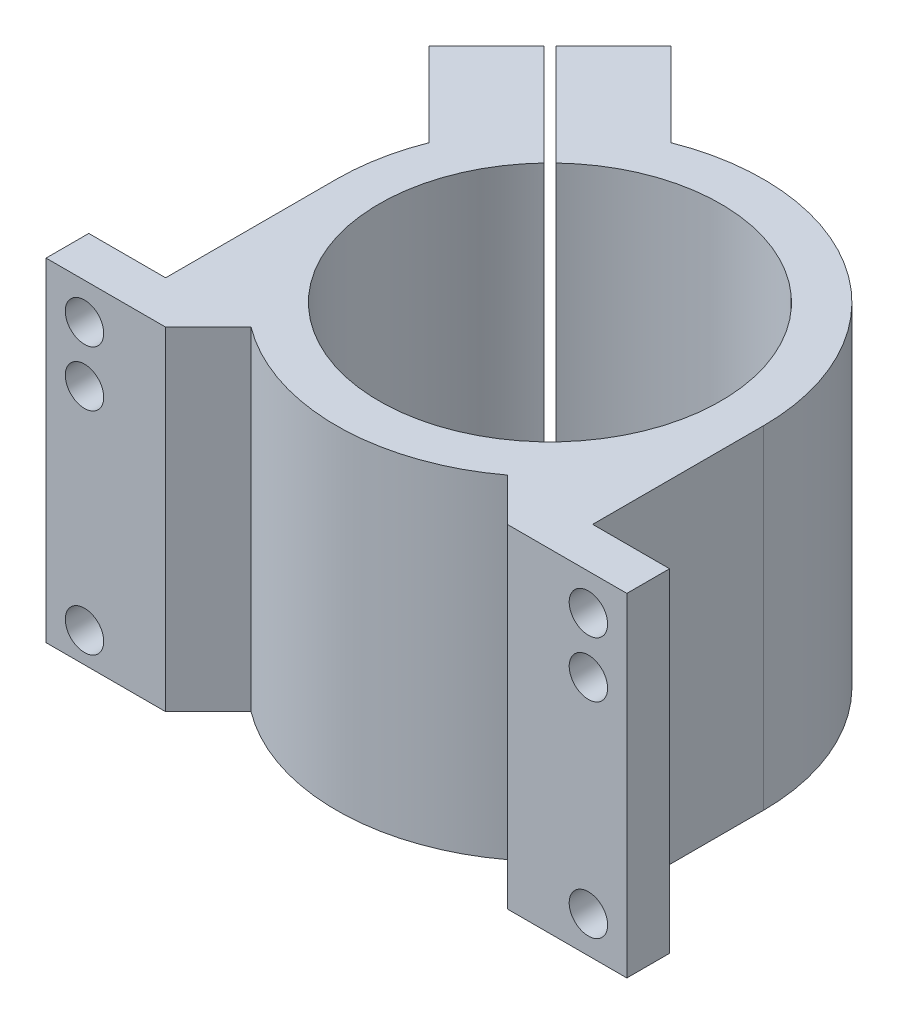
ISO-10303-21;
HEADER;
FILE_DESCRIPTION(('STEP AP214'),'2;1');
FILE_NAME('part.step','',(''),(''),'','','');
FILE_SCHEMA(('AUTOMOTIVE_DESIGN { 1 0 10303 214 1 1 1 1 }'));
ENDSEC;
DATA;
#1=APPLICATION_CONTEXT('core data for automotive mechanical design processes');
#2=APPLICATION_PROTOCOL_DEFINITION('international standard','automotive_design',2000,#1);
#3=PRODUCT_CONTEXT('',#1,'mechanical');
#4=PRODUCT('Part','Part','',(#3));
#5=PRODUCT_RELATED_PRODUCT_CATEGORY('part','',(#4));
#6=PRODUCT_DEFINITION_FORMATION('','',#4);
#7=PRODUCT_DEFINITION_CONTEXT('part definition',#1,'design');
#8=PRODUCT_DEFINITION('design','',#6,#7);
#9=PRODUCT_DEFINITION_SHAPE('','',#8);
#10=(LENGTH_UNIT() NAMED_UNIT(*) SI_UNIT(.MILLI.,.METRE.));
#11=(NAMED_UNIT(*) PLANE_ANGLE_UNIT() SI_UNIT($,.RADIAN.));
#12=(NAMED_UNIT(*) SI_UNIT($,.STERADIAN.) SOLID_ANGLE_UNIT());
#13=UNCERTAINTY_MEASURE_WITH_UNIT(LENGTH_MEASURE(1.E-05),#10,'distance_accuracy_value','');
#14=(GEOMETRIC_REPRESENTATION_CONTEXT(3) GLOBAL_UNCERTAINTY_ASSIGNED_CONTEXT((#13)) GLOBAL_UNIT_ASSIGNED_CONTEXT((#10,
#11,#12)) REPRESENTATION_CONTEXT('',''));
#15=CARTESIAN_POINT('',(0.,0.,0.));
#16=DIRECTION('',(0.,0.,1.));
#17=DIRECTION('',(1.,0.,0.));
#18=AXIS2_PLACEMENT_3D('',#15,#16,#17);
#19=CARTESIAN_POINT('',(-14.142135623731,78.,14.1421356237309));
#20=DIRECTION('',(0.707106781186551,0.,-0.707106781186544));
#21=DIRECTION('',(-0.707106781186544,0.,-0.707106781186551));
#22=AXIS2_PLACEMENT_3D('',#19,#20,#21);
#23=PLANE('',#22);
#24=CARTESIAN_POINT('',(-56.3474267592718,8.5,-28.0631555118103));
#25=DIRECTION('',(0.707106781186551,0.,-0.707106781186544));
#26=DIRECTION('',(-0.707106781186544,0.,-0.707106781186551));
#27=AXIS2_PLACEMENT_3D('',#24,#25,#26);
#28=CIRCLE('',#27,4.49999999999998);
#29=CARTESIAN_POINT('',(-59.5294072746112,8.5,-31.2451360271497));
#30=VERTEX_POINT('',#29);
#31=EDGE_CURVE('E359',#30,#30,#28,.T.);
#32=ORIENTED_EDGE('',*,*,#31,.T.);
#33=EDGE_LOOP('',(#32));
#34=FACE_BOUND('',#33,.T.);
#35=CARTESIAN_POINT('',(-56.3474267592717,69.5,-28.0631555118103));
#36=DIRECTION('',(0.707106781186551,0.,-0.707106781186544));
#37=DIRECTION('',(-0.707106781186544,0.,-0.707106781186551));
#38=AXIS2_PLACEMENT_3D('',#35,#36,#37);
#39=CIRCLE('',#38,4.49999999999998);
#40=CARTESIAN_POINT('',(-59.5294072746112,69.5,-31.2451360271497));
#41=VERTEX_POINT('',#40);
#42=EDGE_CURVE('E356',#41,#41,#39,.T.);
#43=ORIENTED_EDGE('',*,*,#42,.T.);
#44=EDGE_LOOP('',(#43));
#45=FACE_BOUND('',#44,.T.);
#46=DIRECTION('',(0.707106781186544,0.,0.707106781186551));
#47=VECTOR('',#46,1.);
#48=CARTESIAN_POINT('',(-14.142135623731,0.,14.1421356237309));
#49=LINE('',#48,#47);
#50=CARTESIAN_POINT('',(-66.1490144027733,0.,-37.864743155312));
#51=VERTEX_POINT('',#50);
#52=CARTESIAN_POINT('',(-46.5458391157702,0.,-18.2615678683086));
#53=VERTEX_POINT('',#52);
#54=EDGE_CURVE('E219',#51,#53,#49,.T.);
#55=ORIENTED_EDGE('',*,*,#54,.T.);
#56=DIRECTION('',(0.,-1.,0.));
#57=VECTOR('',#56,1.);
#58=CARTESIAN_POINT('',(-46.5458391157702,78.,-18.2615678683086));
#59=LINE('',#58,#57);
#60=CARTESIAN_POINT('',(-46.5458391157702,78.,-18.2615678683086));
#61=VERTEX_POINT('',#60);
#62=EDGE_CURVE('E11',#61,#53,#59,.T.);
#63=ORIENTED_EDGE('',*,*,#62,.F.);
#64=DIRECTION('',(0.707106781186544,0.,0.707106781186551));
#65=VECTOR('',#64,1.);
#66=CARTESIAN_POINT('',(-14.142135623731,78.,14.1421356237309));
#67=LINE('',#66,#65);
#68=CARTESIAN_POINT('',(-66.1490144027733,78.,-37.864743155312));
#69=VERTEX_POINT('',#68);
#70=EDGE_CURVE('E293',#69,#61,#67,.T.);
#71=ORIENTED_EDGE('',*,*,#70,.F.);
#72=DIRECTION('',(0.,-1.,0.));
#73=VECTOR('',#72,1.);
#74=CARTESIAN_POINT('',(-66.1490144027733,78.,-37.864743155312));
#75=LINE('',#74,#73);
#76=EDGE_CURVE('E62',#69,#51,#75,.T.);
#77=ORIENTED_EDGE('',*,*,#76,.T.);
#78=EDGE_LOOP('',(#55,#63,#71,#77));
#79=FACE_BOUND('',#78,.T.);
#80=ADVANCED_FACE('F43',(#34,#45,#79),#23,.F.);
#81=CARTESIAN_POINT('',(0.,78.,0.));
#82=DIRECTION('',(0.,-1.,0.));
#83=DIRECTION('',(0.,0.,-1.));
#84=AXIS2_PLACEMENT_3D('',#81,#82,#83);
#85=CYLINDRICAL_SURFACE('',#84,50.);
#86=CARTESIAN_POINT('',(0.,0.,0.));
#87=DIRECTION('',(0.,1.,0.));
#88=DIRECTION('',(0.,0.,1.));
#89=AXIS2_PLACEMENT_3D('',#86,#87,#88);
#90=CIRCLE('',#89,50.);
#91=CARTESIAN_POINT('',(-50.,0.,0.));
#92=VERTEX_POINT('',#91);
#93=EDGE_CURVE('E222',#53,#92,#90,.T.);
#94=ORIENTED_EDGE('',*,*,#93,.T.);
#95=DIRECTION('',(0.,-1.,0.));
#96=VECTOR('',#95,1.);
#97=CARTESIAN_POINT('',(-50.,78.,0.));
#98=LINE('',#97,#96);
#99=CARTESIAN_POINT('',(-50.,78.,0.));
#100=VERTEX_POINT('',#99);
#101=EDGE_CURVE('E53',#100,#92,#98,.T.);
#102=ORIENTED_EDGE('',*,*,#101,.F.);
#103=CARTESIAN_POINT('',(0.,78.,0.));
#104=DIRECTION('',(0.,1.,0.));
#105=DIRECTION('',(0.,0.,1.));
#106=AXIS2_PLACEMENT_3D('',#103,#104,#105);
#107=CIRCLE('',#106,50.);
#108=EDGE_CURVE('E136',#61,#100,#107,.T.);
#109=ORIENTED_EDGE('',*,*,#108,.F.);
#110=ORIENTED_EDGE('',*,*,#62,.T.);
#111=EDGE_LOOP('',(#94,#102,#109,#110));
#112=FACE_BOUND('',#111,.T.);
#113=ADVANCED_FACE('F501',(#112),#85,.T.);
#114=CARTESIAN_POINT('',(-50.,78.,0.));
#115=DIRECTION('',(1.,0.,0.));
#116=DIRECTION('',(0.,0.,-1.));
#117=AXIS2_PLACEMENT_3D('',#114,#115,#116);
#118=PLANE('',#117);
#119=DIRECTION('',(0.,0.,1.));
#120=VECTOR('',#119,1.);
#121=CARTESIAN_POINT('',(-50.,0.,0.));
#122=LINE('',#121,#120);
#123=CARTESIAN_POINT('',(-50.,0.,40.));
#124=VERTEX_POINT('',#123);
#125=EDGE_CURVE('E226',#92,#124,#122,.T.);
#126=ORIENTED_EDGE('',*,*,#125,.T.);
#127=DIRECTION('',(0.,-1.,0.));
#128=VECTOR('',#127,1.);
#129=CARTESIAN_POINT('',(-50.,78.,40.));
#130=LINE('',#129,#128);
#131=CARTESIAN_POINT('',(-50.,78.,40.));
#132=VERTEX_POINT('',#131);
#133=EDGE_CURVE('E341',#132,#124,#130,.T.);
#134=ORIENTED_EDGE('',*,*,#133,.F.);
#135=DIRECTION('',(0.,0.,1.));
#136=VECTOR('',#135,1.);
#137=CARTESIAN_POINT('',(-50.,78.,0.));
#138=LINE('',#137,#136);
#139=EDGE_CURVE('E423',#100,#132,#138,.T.);
#140=ORIENTED_EDGE('',*,*,#139,.F.);
#141=ORIENTED_EDGE('',*,*,#101,.T.);
#142=EDGE_LOOP('',(#126,#134,#140,#141));
#143=FACE_BOUND('',#142,.T.);
#144=ADVANCED_FACE('F506',(#143),#118,.F.);
#145=CARTESIAN_POINT('',(0.,78.,40.));
#146=DIRECTION('',(0.,0.,-1.));
#147=DIRECTION('',(-1.,0.,0.));
#148=AXIS2_PLACEMENT_3D('',#145,#146,#147);
#149=PLANE('',#148);
#150=CARTESIAN_POINT('',(-59.,69.5,40.));
#151=DIRECTION('',(0.,0.,1.));
#152=DIRECTION('',(1.,0.,0.));
#153=AXIS2_PLACEMENT_3D('',#150,#151,#152);
#154=CIRCLE('',#153,4.5);
#155=CARTESIAN_POINT('',(-54.5,69.5,40.));
#156=VERTEX_POINT('',#155);
#157=EDGE_CURVE('E376',#156,#156,#154,.T.);
#158=ORIENTED_EDGE('',*,*,#157,.T.);
#159=EDGE_LOOP('',(#158));
#160=FACE_BOUND('',#159,.T.);
#161=CARTESIAN_POINT('',(-59.,7.,40.));
#162=DIRECTION('',(0.,0.,1.));
#163=DIRECTION('',(1.,0.,0.));
#164=AXIS2_PLACEMENT_3D('',#161,#162,#163);
#165=CIRCLE('',#164,4.5);
#166=CARTESIAN_POINT('',(-54.5,7.,40.));
#167=VERTEX_POINT('',#166);
#168=EDGE_CURVE('E384',#167,#167,#165,.T.);
#169=ORIENTED_EDGE('',*,*,#168,.T.);
#170=EDGE_LOOP('',(#169));
#171=FACE_BOUND('',#170,.T.);
#172=CARTESIAN_POINT('',(-59.,56.5,40.));
#173=DIRECTION('',(0.,0.,1.));
#174=DIRECTION('',(1.,0.,0.));
#175=AXIS2_PLACEMENT_3D('',#172,#173,#174);
#176=CIRCLE('',#175,4.5);
#177=CARTESIAN_POINT('',(-54.5,56.5,40.));
#178=VERTEX_POINT('',#177);
#179=EDGE_CURVE('E392',#178,#178,#176,.T.);
#180=ORIENTED_EDGE('',*,*,#179,.T.);
#181=EDGE_LOOP('',(#180));
#182=FACE_BOUND('',#181,.T.);
#183=DIRECTION('',(1.,0.,0.));
#184=VECTOR('',#183,1.);
#185=CARTESIAN_POINT('',(0.,0.,40.));
#186=LINE('',#185,#184);
#187=CARTESIAN_POINT('',(-68.,0.,40.));
#188=VERTEX_POINT('',#187);
#189=EDGE_CURVE('E230',#188,#124,#186,.T.);
#190=ORIENTED_EDGE('',*,*,#189,.F.);
#191=DIRECTION('',(0.,-1.,0.));
#192=VECTOR('',#191,1.);
#193=CARTESIAN_POINT('',(-68.,78.,40.));
#194=LINE('',#193,#192);
#195=CARTESIAN_POINT('',(-68.,78.,40.));
#196=VERTEX_POINT('',#195);
#197=EDGE_CURVE('E338',#196,#188,#194,.T.);
#198=ORIENTED_EDGE('',*,*,#197,.F.);
#199=DIRECTION('',(1.,0.,0.));
#200=VECTOR('',#199,1.);
#201=CARTESIAN_POINT('',(0.,78.,40.));
#202=LINE('',#201,#200);
#203=EDGE_CURVE('E426',#196,#132,#202,.T.);
#204=ORIENTED_EDGE('',*,*,#203,.T.);
#205=ORIENTED_EDGE('',*,*,#133,.T.);
#206=EDGE_LOOP('',(#190,#198,#204,#205));
#207=FACE_BOUND('',#206,.T.);
#208=ADVANCED_FACE('F619',(#160,#171,#182,#207),#149,.T.);
#209=CARTESIAN_POINT('',(-67.9999999999999,78.,-1.88737914186276E-13));
#210=DIRECTION('',(-1.,0.,0.));
#211=DIRECTION('',(0.,0.,1.));
#212=AXIS2_PLACEMENT_3D('',#209,#210,#211);
#213=PLANE('',#212);
#214=DIRECTION('',(0.,0.,-1.));
#215=VECTOR('',#214,1.);
#216=CARTESIAN_POINT('',(-67.9999999999999,0.,-1.88737914186276E-13));
#217=LINE('',#216,#215);
#218=CARTESIAN_POINT('',(-68.,0.,50.));
#219=VERTEX_POINT('',#218);
#220=EDGE_CURVE('E234',#219,#188,#217,.T.);
#221=ORIENTED_EDGE('',*,*,#220,.F.);
#222=DIRECTION('',(0.,-1.,0.));
#223=VECTOR('',#222,1.);
#224=CARTESIAN_POINT('',(-68.,78.,50.));
#225=LINE('',#224,#223);
#226=CARTESIAN_POINT('',(-68.,78.,50.));
#227=VERTEX_POINT('',#226);
#228=EDGE_CURVE('E335',#227,#219,#225,.T.);
#229=ORIENTED_EDGE('',*,*,#228,.F.);
#230=DIRECTION('',(0.,0.,-1.));
#231=VECTOR('',#230,1.);
#232=CARTESIAN_POINT('',(-67.9999999999999,78.,-1.88737914186276E-13));
#233=LINE('',#232,#231);
#234=EDGE_CURVE('E430',#227,#196,#233,.T.);
#235=ORIENTED_EDGE('',*,*,#234,.T.);
#236=ORIENTED_EDGE('',*,*,#197,.T.);
#237=EDGE_LOOP('',(#221,#229,#235,#236));
#238=FACE_BOUND('',#237,.T.);
#239=ADVANCED_FACE('F615',(#238),#213,.T.);
#240=CARTESIAN_POINT('',(0.,78.,50.));
#241=DIRECTION('',(0.,0.,1.));
#242=DIRECTION('',(1.,0.,0.));
#243=AXIS2_PLACEMENT_3D('',#240,#241,#242);
#244=PLANE('',#243);
#245=CARTESIAN_POINT('',(-59.,69.5,50.));
#246=DIRECTION('',(0.,0.,1.));
#247=DIRECTION('',(1.,0.,0.));
#248=AXIS2_PLACEMENT_3D('',#245,#246,#247);
#249=CIRCLE('',#248,4.5);
#250=CARTESIAN_POINT('',(-54.5,69.5,50.));
#251=VERTEX_POINT('',#250);
#252=EDGE_CURVE('E372',#251,#251,#249,.T.);
#253=ORIENTED_EDGE('',*,*,#252,.F.);
#254=EDGE_LOOP('',(#253));
#255=FACE_BOUND('',#254,.T.);
#256=CARTESIAN_POINT('',(-59.,7.,50.));
#257=DIRECTION('',(0.,0.,1.));
#258=DIRECTION('',(1.,0.,0.));
#259=AXIS2_PLACEMENT_3D('',#256,#257,#258);
#260=CIRCLE('',#259,4.5);
#261=CARTESIAN_POINT('',(-54.5,7.,50.));
#262=VERTEX_POINT('',#261);
#263=EDGE_CURVE('E380',#262,#262,#260,.T.);
#264=ORIENTED_EDGE('',*,*,#263,.F.);
#265=EDGE_LOOP('',(#264));
#266=FACE_BOUND('',#265,.T.);
#267=CARTESIAN_POINT('',(-59.,56.5,50.));
#268=DIRECTION('',(0.,0.,1.));
#269=DIRECTION('',(1.,0.,0.));
#270=AXIS2_PLACEMENT_3D('',#267,#268,#269);
#271=CIRCLE('',#270,4.5);
#272=CARTESIAN_POINT('',(-54.5,56.5,50.));
#273=VERTEX_POINT('',#272);
#274=EDGE_CURVE('E388',#273,#273,#271,.T.);
#275=ORIENTED_EDGE('',*,*,#274,.F.);
#276=EDGE_LOOP('',(#275));
#277=FACE_BOUND('',#276,.T.);
#278=DIRECTION('',(-1.,0.,0.));
#279=VECTOR('',#278,1.);
#280=CARTESIAN_POINT('',(0.,0.,50.));
#281=LINE('',#280,#279);
#282=CARTESIAN_POINT('',(-40.,0.,50.));
#283=VERTEX_POINT('',#282);
#284=EDGE_CURVE('E238',#283,#219,#281,.T.);
#285=ORIENTED_EDGE('',*,*,#284,.F.);
#286=DIRECTION('',(0.,-1.,0.));
#287=VECTOR('',#286,1.);
#288=CARTESIAN_POINT('',(-40.,78.,50.));
#289=LINE('',#288,#287);
#290=CARTESIAN_POINT('',(-40.,78.,50.));
#291=VERTEX_POINT('',#290);
#292=EDGE_CURVE('E332',#291,#283,#289,.T.);
#293=ORIENTED_EDGE('',*,*,#292,.F.);
#294=DIRECTION('',(-1.,0.,0.));
#295=VECTOR('',#294,1.);
#296=CARTESIAN_POINT('',(0.,78.,50.));
#297=LINE('',#296,#295);
#298=EDGE_CURVE('E434',#291,#227,#297,.T.);
#299=ORIENTED_EDGE('',*,*,#298,.T.);
#300=ORIENTED_EDGE('',*,*,#228,.T.);
#301=EDGE_LOOP('',(#285,#293,#299,#300));
#302=FACE_BOUND('',#301,.T.);
#303=ADVANCED_FACE('F611',(#255,#266,#277,#302),#244,.T.);
#304=CARTESIAN_POINT('',(4.99999999999994,78.,4.99999999999992));
#305=DIRECTION('',(-0.707106781186549,0.,-0.707106781186546));
#306=DIRECTION('',(-0.707106781186546,0.,0.707106781186549));
#307=AXIS2_PLACEMENT_3D('',#304,#305,#306);
#308=PLANE('',#307);
#309=DIRECTION('',(0.707106781186546,0.,-0.707106781186549));
#310=VECTOR('',#309,1.);
#311=CARTESIAN_POINT('',(4.99999999999994,0.,4.99999999999992));
#312=LINE('',#311,#310);
#313=CARTESIAN_POINT('',(-30.,0.,40.));
#314=VERTEX_POINT('',#313);
#315=EDGE_CURVE('E242',#283,#314,#312,.T.);
#316=ORIENTED_EDGE('',*,*,#315,.T.);
#317=DIRECTION('',(0.,-1.,0.));
#318=VECTOR('',#317,1.);
#319=CARTESIAN_POINT('',(-30.,78.,40.));
#320=LINE('',#319,#318);
#321=CARTESIAN_POINT('',(-30.,78.,40.));
#322=VERTEX_POINT('',#321);
#323=EDGE_CURVE('E328',#322,#314,#320,.T.);
#324=ORIENTED_EDGE('',*,*,#323,.F.);
#325=DIRECTION('',(0.707106781186546,0.,-0.707106781186549));
#326=VECTOR('',#325,1.);
#327=CARTESIAN_POINT('',(4.99999999999994,78.,4.99999999999992));
#328=LINE('',#327,#326);
#329=EDGE_CURVE('E438',#291,#322,#328,.T.);
#330=ORIENTED_EDGE('',*,*,#329,.F.);
#331=ORIENTED_EDGE('',*,*,#292,.T.);
#332=EDGE_LOOP('',(#316,#324,#330,#331));
#333=FACE_BOUND('',#332,.T.);
#334=ADVANCED_FACE('F607',(#333),#308,.F.);
#335=CARTESIAN_POINT('',(0.,78.,0.));
#336=DIRECTION('',(0.,-1.,0.));
#337=DIRECTION('',(0.,0.,-1.));
#338=AXIS2_PLACEMENT_3D('',#335,#336,#337);
#339=CYLINDRICAL_SURFACE('',#338,50.);
#340=CARTESIAN_POINT('',(0.,0.,0.));
#341=DIRECTION('',(0.,1.,0.));
#342=DIRECTION('',(0.,0.,1.));
#343=AXIS2_PLACEMENT_3D('',#340,#341,#342);
#344=CIRCLE('',#343,50.);
#345=CARTESIAN_POINT('',(30.,0.,40.));
#346=VERTEX_POINT('',#345);
#347=EDGE_CURVE('E245',#314,#346,#344,.T.);
#348=ORIENTED_EDGE('',*,*,#347,.T.);
#349=DIRECTION('',(0.,-1.,0.));
#350=VECTOR('',#349,1.);
#351=CARTESIAN_POINT('',(30.,78.,40.));
#352=LINE('',#351,#350);
#353=CARTESIAN_POINT('',(30.,78.,40.));
#354=VERTEX_POINT('',#353);
#355=EDGE_CURVE('E325',#354,#346,#352,.T.);
#356=ORIENTED_EDGE('',*,*,#355,.F.);
#357=CARTESIAN_POINT('',(0.,78.,0.));
#358=DIRECTION('',(0.,1.,0.));
#359=DIRECTION('',(0.,0.,1.));
#360=AXIS2_PLACEMENT_3D('',#357,#358,#359);
#361=CIRCLE('',#360,50.);
#362=EDGE_CURVE('E441',#322,#354,#361,.T.);
#363=ORIENTED_EDGE('',*,*,#362,.F.);
#364=ORIENTED_EDGE('',*,*,#323,.T.);
#365=EDGE_LOOP('',(#348,#356,#363,#364));
#366=FACE_BOUND('',#365,.T.);
#367=ADVANCED_FACE('F603',(#366),#339,.T.);
#368=CARTESIAN_POINT('',(-4.99999999999994,78.,4.99999999999992));
#369=DIRECTION('',(-0.707106781186549,0.,0.707106781186546));
#370=DIRECTION('',(0.707106781186546,0.,0.707106781186549));
#371=AXIS2_PLACEMENT_3D('',#368,#369,#370);
#372=PLANE('',#371);
#373=DIRECTION('',(-0.707106781186546,0.,-0.707106781186549));
#374=VECTOR('',#373,1.);
#375=CARTESIAN_POINT('',(-4.99999999999994,0.,4.99999999999992));
#376=LINE('',#375,#374);
#377=CARTESIAN_POINT('',(40.,0.,50.));
#378=VERTEX_POINT('',#377);
#379=EDGE_CURVE('E249',#378,#346,#376,.T.);
#380=ORIENTED_EDGE('',*,*,#379,.F.);
#381=DIRECTION('',(0.,-1.,0.));
#382=VECTOR('',#381,1.);
#383=CARTESIAN_POINT('',(40.,78.,50.));
#384=LINE('',#383,#382);
#385=CARTESIAN_POINT('',(40.,78.,50.));
#386=VERTEX_POINT('',#385);
#387=EDGE_CURVE('E322',#386,#378,#384,.T.);
#388=ORIENTED_EDGE('',*,*,#387,.F.);
#389=DIRECTION('',(-0.707106781186546,0.,-0.707106781186549));
#390=VECTOR('',#389,1.);
#391=CARTESIAN_POINT('',(-4.99999999999994,78.,4.99999999999992));
#392=LINE('',#391,#390);
#393=EDGE_CURVE('E444',#386,#354,#392,.T.);
#394=ORIENTED_EDGE('',*,*,#393,.T.);
#395=ORIENTED_EDGE('',*,*,#355,.T.);
#396=EDGE_LOOP('',(#380,#388,#394,#395));
#397=FACE_BOUND('',#396,.T.);
#398=ADVANCED_FACE('F599',(#397),#372,.T.);
#399=CARTESIAN_POINT('',(0.,78.,50.));
#400=DIRECTION('',(0.,0.,1.));
#401=DIRECTION('',(1.,0.,0.));
#402=AXIS2_PLACEMENT_3D('',#399,#400,#401);
#403=PLANE('',#402);
#404=CARTESIAN_POINT('',(59.,56.5,50.));
#405=DIRECTION('',(0.,0.,1.));
#406=DIRECTION('',(1.,0.,0.));
#407=AXIS2_PLACEMENT_3D('',#404,#405,#406);
#408=CIRCLE('',#407,4.5);
#409=CARTESIAN_POINT('',(63.5,56.5,50.));
#410=VERTEX_POINT('',#409);
#411=EDGE_CURVE('E396',#410,#410,#408,.T.);
#412=ORIENTED_EDGE('',*,*,#411,.F.);
#413=EDGE_LOOP('',(#412));
#414=FACE_BOUND('',#413,.T.);
#415=CARTESIAN_POINT('',(59.,8.5,50.));
#416=DIRECTION('',(0.,0.,1.));
#417=DIRECTION('',(1.,0.,0.));
#418=AXIS2_PLACEMENT_3D('',#415,#416,#417);
#419=CIRCLE('',#418,4.5);
#420=CARTESIAN_POINT('',(63.5,8.5,50.));
#421=VERTEX_POINT('',#420);
#422=EDGE_CURVE('E404',#421,#421,#419,.T.);
#423=ORIENTED_EDGE('',*,*,#422,.F.);
#424=EDGE_LOOP('',(#423));
#425=FACE_BOUND('',#424,.T.);
#426=CARTESIAN_POINT('',(59.,69.5,50.));
#427=DIRECTION('',(0.,0.,1.));
#428=DIRECTION('',(1.,0.,0.));
#429=AXIS2_PLACEMENT_3D('',#426,#427,#428);
#430=CIRCLE('',#429,4.5);
#431=CARTESIAN_POINT('',(63.5,69.5,50.));
#432=VERTEX_POINT('',#431);
#433=EDGE_CURVE('E412',#432,#432,#430,.T.);
#434=ORIENTED_EDGE('',*,*,#433,.F.);
#435=EDGE_LOOP('',(#434));
#436=FACE_BOUND('',#435,.T.);
#437=DIRECTION('',(-1.,0.,0.));
#438=VECTOR('',#437,1.);
#439=CARTESIAN_POINT('',(0.,0.,50.));
#440=LINE('',#439,#438);
#441=CARTESIAN_POINT('',(68.,0.,50.));
#442=VERTEX_POINT('',#441);
#443=EDGE_CURVE('E253',#442,#378,#440,.T.);
#444=ORIENTED_EDGE('',*,*,#443,.F.);
#445=DIRECTION('',(0.,-1.,0.));
#446=VECTOR('',#445,1.);
#447=CARTESIAN_POINT('',(68.,78.,50.));
#448=LINE('',#447,#446);
#449=CARTESIAN_POINT('',(68.,78.,50.));
#450=VERTEX_POINT('',#449);
#451=EDGE_CURVE('E319',#450,#442,#448,.T.);
#452=ORIENTED_EDGE('',*,*,#451,.F.);
#453=DIRECTION('',(-1.,0.,0.));
#454=VECTOR('',#453,1.);
#455=CARTESIAN_POINT('',(0.,78.,50.));
#456=LINE('',#455,#454);
#457=EDGE_CURVE('E448',#450,#386,#456,.T.);
#458=ORIENTED_EDGE('',*,*,#457,.T.);
#459=ORIENTED_EDGE('',*,*,#387,.T.);
#460=EDGE_LOOP('',(#444,#452,#458,#459));
#461=FACE_BOUND('',#460,.T.);
#462=ADVANCED_FACE('F595',(#414,#425,#436,#461),#403,.T.);
#463=CARTESIAN_POINT('',(67.9999999999999,78.,-1.88737914186276E-13));
#464=DIRECTION('',(-1.,0.,0.));
#465=DIRECTION('',(0.,0.,1.));
#466=AXIS2_PLACEMENT_3D('',#463,#464,#465);
#467=PLANE('',#466);
#468=DIRECTION('',(0.,0.,-1.));
#469=VECTOR('',#468,1.);
#470=CARTESIAN_POINT('',(67.9999999999999,0.,-1.88737914186276E-13));
#471=LINE('',#470,#469);
#472=CARTESIAN_POINT('',(68.,0.,40.));
#473=VERTEX_POINT('',#472);
#474=EDGE_CURVE('E257',#442,#473,#471,.T.);
#475=ORIENTED_EDGE('',*,*,#474,.T.);
#476=DIRECTION('',(0.,-1.,0.));
#477=VECTOR('',#476,1.);
#478=CARTESIAN_POINT('',(68.,78.,40.));
#479=LINE('',#478,#477);
#480=CARTESIAN_POINT('',(68.,78.,40.));
#481=VERTEX_POINT('',#480);
#482=EDGE_CURVE('E315',#481,#473,#479,.T.);
#483=ORIENTED_EDGE('',*,*,#482,.F.);
#484=DIRECTION('',(0.,0.,-1.));
#485=VECTOR('',#484,1.);
#486=CARTESIAN_POINT('',(67.9999999999999,78.,-1.88737914186276E-13));
#487=LINE('',#486,#485);
#488=EDGE_CURVE('E452',#450,#481,#487,.T.);
#489=ORIENTED_EDGE('',*,*,#488,.F.);
#490=ORIENTED_EDGE('',*,*,#451,.T.);
#491=EDGE_LOOP('',(#475,#483,#489,#490));
#492=FACE_BOUND('',#491,.T.);
#493=ADVANCED_FACE('F591',(#492),#467,.F.);
#494=CARTESIAN_POINT('',(0.,78.,40.));
#495=DIRECTION('',(0.,0.,1.));
#496=DIRECTION('',(1.,0.,0.));
#497=AXIS2_PLACEMENT_3D('',#494,#495,#496);
#498=PLANE('',#497);
#499=CARTESIAN_POINT('',(59.,56.5,40.));
#500=DIRECTION('',(0.,0.,1.));
#501=DIRECTION('',(1.,0.,0.));
#502=AXIS2_PLACEMENT_3D('',#499,#500,#501);
#503=CIRCLE('',#502,4.5);
#504=CARTESIAN_POINT('',(63.5,56.5,40.));
#505=VERTEX_POINT('',#504);
#506=EDGE_CURVE('E400',#505,#505,#503,.T.);
#507=ORIENTED_EDGE('',*,*,#506,.T.);
#508=EDGE_LOOP('',(#507));
#509=FACE_BOUND('',#508,.T.);
#510=CARTESIAN_POINT('',(59.,8.5,40.));
#511=DIRECTION('',(0.,0.,1.));
#512=DIRECTION('',(1.,0.,0.));
#513=AXIS2_PLACEMENT_3D('',#510,#511,#512);
#514=CIRCLE('',#513,4.5);
#515=CARTESIAN_POINT('',(63.5,8.5,40.));
#516=VERTEX_POINT('',#515);
#517=EDGE_CURVE('E408',#516,#516,#514,.T.);
#518=ORIENTED_EDGE('',*,*,#517,.T.);
#519=EDGE_LOOP('',(#518));
#520=FACE_BOUND('',#519,.T.);
#521=CARTESIAN_POINT('',(59.,69.5,40.));
#522=DIRECTION('',(0.,0.,1.));
#523=DIRECTION('',(1.,0.,0.));
#524=AXIS2_PLACEMENT_3D('',#521,#522,#523);
#525=CIRCLE('',#524,4.5);
#526=CARTESIAN_POINT('',(63.5,69.5,40.));
#527=VERTEX_POINT('',#526);
#528=EDGE_CURVE('E223',#527,#527,#525,.T.);
#529=ORIENTED_EDGE('',*,*,#528,.T.);
#530=EDGE_LOOP('',(#529));
#531=FACE_BOUND('',#530,.T.);
#532=DIRECTION('',(-1.,0.,0.));
#533=VECTOR('',#532,1.);
#534=CARTESIAN_POINT('',(0.,0.,40.));
#535=LINE('',#534,#533);
#536=CARTESIAN_POINT('',(50.,0.,40.));
#537=VERTEX_POINT('',#536);
#538=EDGE_CURVE('E260',#473,#537,#535,.T.);
#539=ORIENTED_EDGE('',*,*,#538,.T.);
#540=DIRECTION('',(0.,-1.,0.));
#541=VECTOR('',#540,1.);
#542=CARTESIAN_POINT('',(50.,78.,40.));
#543=LINE('',#542,#541);
#544=CARTESIAN_POINT('',(50.,78.,40.));
#545=VERTEX_POINT('',#544);
#546=EDGE_CURVE('E312',#545,#537,#543,.T.);
#547=ORIENTED_EDGE('',*,*,#546,.F.);
#548=DIRECTION('',(-1.,0.,0.));
#549=VECTOR('',#548,1.);
#550=CARTESIAN_POINT('',(0.,78.,40.));
#551=LINE('',#550,#549);
#552=EDGE_CURVE('E455',#481,#545,#551,.T.);
#553=ORIENTED_EDGE('',*,*,#552,.F.);
#554=ORIENTED_EDGE('',*,*,#482,.T.);
#555=EDGE_LOOP('',(#539,#547,#553,#554));
#556=FACE_BOUND('',#555,.T.);
#557=ADVANCED_FACE('F587',(#509,#520,#531,#556),#498,.F.);
#558=CARTESIAN_POINT('',(50.,78.,0.));
#559=DIRECTION('',(1.,0.,0.));
#560=DIRECTION('',(0.,0.,-1.));
#561=AXIS2_PLACEMENT_3D('',#558,#559,#560);
#562=PLANE('',#561);
#563=DIRECTION('',(0.,0.,1.));
#564=VECTOR('',#563,1.);
#565=CARTESIAN_POINT('',(50.,0.,0.));
#566=LINE('',#565,#564);
#567=CARTESIAN_POINT('',(50.,0.,0.));
#568=VERTEX_POINT('',#567);
#569=EDGE_CURVE('E264',#568,#537,#566,.T.);
#570=ORIENTED_EDGE('',*,*,#569,.F.);
#571=DIRECTION('',(0.,-1.,0.));
#572=VECTOR('',#571,1.);
#573=CARTESIAN_POINT('',(50.,78.,0.));
#574=LINE('',#573,#572);
#575=CARTESIAN_POINT('',(50.,78.,0.));
#576=VERTEX_POINT('',#575);
#577=EDGE_CURVE('E309',#576,#568,#574,.T.);
#578=ORIENTED_EDGE('',*,*,#577,.F.);
#579=DIRECTION('',(0.,0.,1.));
#580=VECTOR('',#579,1.);
#581=CARTESIAN_POINT('',(50.,78.,0.));
#582=LINE('',#581,#580);
#583=EDGE_CURVE('E458',#576,#545,#582,.T.);
#584=ORIENTED_EDGE('',*,*,#583,.T.);
#585=ORIENTED_EDGE('',*,*,#546,.T.);
#586=EDGE_LOOP('',(#570,#578,#584,#585));
#587=FACE_BOUND('',#586,.T.);
#588=ADVANCED_FACE('F581',(#587),#562,.T.);
#589=CARTESIAN_POINT('',(0.,78.,0.));
#590=DIRECTION('',(0.,-1.,0.));
#591=DIRECTION('',(0.,0.,-1.));
#592=AXIS2_PLACEMENT_3D('',#589,#590,#591);
#593=CYLINDRICAL_SURFACE('',#592,50.);
#594=CARTESIAN_POINT('',(0.,0.,0.));
#595=DIRECTION('',(0.,1.,0.));
#596=DIRECTION('',(0.,0.,1.));
#597=AXIS2_PLACEMENT_3D('',#594,#595,#596);
#598=CIRCLE('',#597,50.);
#599=CARTESIAN_POINT('',(-18.2615678683081,0.,-46.5458391157704));
#600=VERTEX_POINT('',#599);
#601=EDGE_CURVE('E268',#568,#600,#598,.T.);
#602=ORIENTED_EDGE('',*,*,#601,.T.);
#603=DIRECTION('',(0.,-1.,0.));
#604=VECTOR('',#603,1.);
#605=CARTESIAN_POINT('',(-18.2615678683081,78.,-46.5458391157704));
#606=LINE('',#605,#604);
#607=CARTESIAN_POINT('',(-18.2615678683081,78.,-46.5458391157704));
#608=VERTEX_POINT('',#607);
#609=EDGE_CURVE('E306',#608,#600,#606,.T.);
#610=ORIENTED_EDGE('',*,*,#609,.F.);
#611=CARTESIAN_POINT('',(0.,78.,0.));
#612=DIRECTION('',(0.,1.,0.));
#613=DIRECTION('',(0.,0.,1.));
#614=AXIS2_PLACEMENT_3D('',#611,#612,#613);
#615=CIRCLE('',#614,50.);
#616=EDGE_CURVE('E462',#576,#608,#615,.T.);
#617=ORIENTED_EDGE('',*,*,#616,.F.);
#618=ORIENTED_EDGE('',*,*,#577,.T.);
#619=EDGE_LOOP('',(#602,#610,#617,#618));
#620=FACE_BOUND('',#619,.T.);
#621=ADVANCED_FACE('F576',(#620),#593,.T.);
#622=CARTESIAN_POINT('',(14.142135623731,78.,-14.1421356237309));
#623=DIRECTION('',(0.707106781186551,0.,-0.707106781186544));
#624=DIRECTION('',(-0.707106781186544,0.,-0.707106781186551));
#625=AXIS2_PLACEMENT_3D('',#622,#623,#624);
#626=PLANE('',#625);
#627=CARTESIAN_POINT('',(-28.0631555118097,8.5,-56.347426759272));
#628=DIRECTION('',(0.707106781186551,0.,-0.707106781186544));
#629=DIRECTION('',(-0.707106781186544,0.,-0.707106781186551));
#630=AXIS2_PLACEMENT_3D('',#627,#628,#629);
#631=CIRCLE('',#630,4.49999999999999);
#632=CARTESIAN_POINT('',(-31.2451360271492,8.5,-59.5294072746115));
#633=VERTEX_POINT('',#632);
#634=EDGE_CURVE('E566',#633,#633,#631,.T.);
#635=ORIENTED_EDGE('',*,*,#634,.F.);
#636=EDGE_LOOP('',(#635));
#637=FACE_BOUND('',#636,.T.);
#638=CARTESIAN_POINT('',(-28.0631555118097,69.5,-56.347426759272));
#639=DIRECTION('',(0.707106781186551,0.,-0.707106781186544));
#640=DIRECTION('',(-0.707106781186544,0.,-0.707106781186551));
#641=AXIS2_PLACEMENT_3D('',#638,#639,#640);
#642=CIRCLE('',#641,4.49999999999999);
#643=CARTESIAN_POINT('',(-31.2451360271492,69.5,-59.5294072746115));
#644=VERTEX_POINT('',#643);
#645=EDGE_CURVE('E350',#644,#644,#642,.T.);
#646=ORIENTED_EDGE('',*,*,#645,.F.);
#647=EDGE_LOOP('',(#646));
#648=FACE_BOUND('',#647,.T.);
#649=DIRECTION('',(0.707106781186544,0.,0.707106781186551));
#650=VECTOR('',#649,1.);
#651=CARTESIAN_POINT('',(14.142135623731,0.,-14.1421356237309));
#652=LINE('',#651,#650);
#653=CARTESIAN_POINT('',(-37.8647431553113,0.,-66.1490144027737));
#654=VERTEX_POINT('',#653);
#655=EDGE_CURVE('E272',#654,#600,#652,.T.);
#656=ORIENTED_EDGE('',*,*,#655,.F.);
#657=DIRECTION('',(0.,-1.,0.));
#658=VECTOR('',#657,1.);
#659=CARTESIAN_POINT('',(-37.8647431553113,78.,-66.1490144027737));
#660=LINE('',#659,#658);
#661=CARTESIAN_POINT('',(-37.8647431553113,78.,-66.1490144027737));
#662=VERTEX_POINT('',#661);
#663=EDGE_CURVE('E303',#662,#654,#660,.T.);
#664=ORIENTED_EDGE('',*,*,#663,.F.);
#665=DIRECTION('',(0.707106781186544,0.,0.707106781186551));
#666=VECTOR('',#665,1.);
#667=CARTESIAN_POINT('',(14.142135623731,78.,-14.1421356237309));
#668=LINE('',#667,#666);
#669=EDGE_CURVE('E465',#662,#608,#668,.T.);
#670=ORIENTED_EDGE('',*,*,#669,.T.);
#671=ORIENTED_EDGE('',*,*,#609,.T.);
#672=EDGE_LOOP('',(#656,#664,#670,#671));
#673=FACE_BOUND('',#672,.T.);
#674=ADVANCED_FACE('F482',(#637,#648,#673),#626,.T.);
#675=CARTESIAN_POINT('',(-52.0068787790423,78.,-52.0068787790429));
#676=DIRECTION('',(-0.707106781186544,0.,-0.707106781186551));
#677=DIRECTION('',(-0.707106781186551,0.,0.707106781186544));
#678=AXIS2_PLACEMENT_3D('',#675,#676,#677);
#679=PLANE('',#678);
#680=DIRECTION('',(0.707106781186551,0.,-0.707106781186544));
#681=VECTOR('',#680,1.);
#682=CARTESIAN_POINT('',(-52.0068787790423,0.,-52.0068787790429));
#683=LINE('',#682,#681);
#684=CARTESIAN_POINT('',(-51.2997719978558,0.,-52.7139855602294));
#685=VERTEX_POINT('',#684);
#686=EDGE_CURVE('E276',#685,#654,#683,.T.);
#687=ORIENTED_EDGE('',*,*,#686,.F.);
#688=DIRECTION('',(0.,-1.,0.));
#689=VECTOR('',#688,1.);
#690=CARTESIAN_POINT('',(-51.2997719978558,78.,-52.7139855602294));
#691=LINE('',#690,#689);
#692=CARTESIAN_POINT('',(-51.2997719978558,78.,-52.7139855602294));
#693=VERTEX_POINT('',#692);
#694=EDGE_CURVE('E300',#693,#685,#691,.T.);
#695=ORIENTED_EDGE('',*,*,#694,.F.);
#696=DIRECTION('',(0.707106781186551,0.,-0.707106781186544));
#697=VECTOR('',#696,1.);
#698=CARTESIAN_POINT('',(-52.0068787790423,78.,-52.0068787790429));
#699=LINE('',#698,#697);
#700=EDGE_CURVE('E469',#693,#662,#699,.T.);
#701=ORIENTED_EDGE('',*,*,#700,.T.);
#702=ORIENTED_EDGE('',*,*,#663,.T.);
#703=EDGE_LOOP('',(#687,#695,#701,#702));
#704=FACE_BOUND('',#703,.T.);
#705=ADVANCED_FACE('F475',(#704),#679,.T.);
#706=CARTESIAN_POINT('',(0.707106781186552,78.,-0.707106781186544));
#707=DIRECTION('',(0.707106781186551,0.,-0.707106781186544));
#708=DIRECTION('',(-0.707106781186544,0.,-0.707106781186551));
#709=AXIS2_PLACEMENT_3D('',#706,#707,#708);
#710=PLANE('',#709);
#711=CARTESIAN_POINT('',(-41.4981843543542,8.5,-42.9123979167277));
#712=DIRECTION('',(0.707106781186551,0.,-0.707106781186544));
#713=DIRECTION('',(-0.707106781186544,0.,-0.707106781186551));
#714=AXIS2_PLACEMENT_3D('',#711,#712,#713);
#715=CIRCLE('',#714,4.49999999999998);
#716=CARTESIAN_POINT('',(-44.6801648696936,8.5,-46.0943784320672));
#717=VERTEX_POINT('',#716);
#718=EDGE_CURVE('E365',#717,#717,#715,.T.);
#719=ORIENTED_EDGE('',*,*,#718,.T.);
#720=EDGE_LOOP('',(#719));
#721=FACE_BOUND('',#720,.T.);
#722=CARTESIAN_POINT('',(-41.4981843543542,69.5,-42.9123979167277));
#723=DIRECTION('',(0.707106781186551,0.,-0.707106781186544));
#724=DIRECTION('',(-0.707106781186544,0.,-0.707106781186551));
#725=AXIS2_PLACEMENT_3D('',#722,#723,#724);
#726=CIRCLE('',#725,4.49999999999998);
#727=CARTESIAN_POINT('',(-44.6801648696936,69.5,-46.0943784320672));
#728=VERTEX_POINT('',#727);
#729=EDGE_CURVE('E349',#728,#728,#726,.T.);
#730=ORIENTED_EDGE('',*,*,#729,.T.);
#731=EDGE_LOOP('',(#730));
#732=FACE_BOUND('',#731,.T.);
#733=DIRECTION('',(0.707106781186544,0.,0.707106781186551));
#734=VECTOR('',#733,1.);
#735=CARTESIAN_POINT('',(0.707106781186552,0.,-0.707106781186544));
#736=LINE('',#735,#734);
#737=CARTESIAN_POINT('',(-27.5683242500107,0.,-28.9825378123841));
#738=VERTEX_POINT('',#737);
#739=EDGE_CURVE('E280',#685,#738,#736,.T.);
#740=ORIENTED_EDGE('',*,*,#739,.T.);
#741=DIRECTION('',(0.,-1.,0.));
#742=VECTOR('',#741,1.);
#743=CARTESIAN_POINT('',(-27.5683242500107,78.,-28.9825378123841));
#744=LINE('',#743,#742);
#745=CARTESIAN_POINT('',(-27.5683242500107,78.,-28.9825378123841));
#746=VERTEX_POINT('',#745);
#747=EDGE_CURVE('E198',#746,#738,#744,.T.);
#748=ORIENTED_EDGE('',*,*,#747,.F.);
#749=DIRECTION('',(0.707106781186544,0.,0.707106781186551));
#750=VECTOR('',#749,1.);
#751=CARTESIAN_POINT('',(0.707106781186552,78.,-0.707106781186544));
#752=LINE('',#751,#750);
#753=EDGE_CURVE('E207',#693,#746,#752,.T.);
#754=ORIENTED_EDGE('',*,*,#753,.F.);
#755=ORIENTED_EDGE('',*,*,#694,.T.);
#756=EDGE_LOOP('',(#740,#748,#754,#755));
#757=FACE_BOUND('',#756,.T.);
#758=ADVANCED_FACE('F488',(#721,#732,#757),#710,.F.);
#759=CARTESIAN_POINT('',(0.,78.,0.));
#760=DIRECTION('',(0.,-1.,0.));
#761=DIRECTION('',(0.,0.,-1.));
#762=AXIS2_PLACEMENT_3D('',#759,#760,#761);
#763=CYLINDRICAL_SURFACE('',#762,40.);
#764=CARTESIAN_POINT('',(0.,0.,0.));
#765=DIRECTION('',(0.,1.,0.));
#766=DIRECTION('',(0.,0.,1.));
#767=AXIS2_PLACEMENT_3D('',#764,#765,#766);
#768=CIRCLE('',#767,40.);
#769=CARTESIAN_POINT('',(-28.9825378123838,0.,-27.568324250011));
#770=VERTEX_POINT('',#769);
#771=EDGE_CURVE('E193',#770,#738,#768,.T.);
#772=ORIENTED_EDGE('',*,*,#771,.F.);
#773=DIRECTION('',(0.,-1.,0.));
#774=VECTOR('',#773,1.);
#775=CARTESIAN_POINT('',(-28.9825378123838,78.,-27.568324250011));
#776=LINE('',#775,#774);
#777=CARTESIAN_POINT('',(-28.9825378123838,78.,-27.568324250011));
#778=VERTEX_POINT('',#777);
#779=EDGE_CURVE('E188',#778,#770,#776,.T.);
#780=ORIENTED_EDGE('',*,*,#779,.F.);
#781=CARTESIAN_POINT('',(0.,78.,0.));
#782=DIRECTION('',(0.,1.,0.));
#783=DIRECTION('',(0.,0.,1.));
#784=AXIS2_PLACEMENT_3D('',#781,#782,#783);
#785=CIRCLE('',#784,40.);
#786=EDGE_CURVE('E191',#778,#746,#785,.T.);
#787=ORIENTED_EDGE('',*,*,#786,.T.);
#788=ORIENTED_EDGE('',*,*,#747,.T.);
#789=EDGE_LOOP('',(#772,#780,#787,#788));
#790=FACE_BOUND('',#789,.T.);
#791=ADVANCED_FACE('F190',(#790),#763,.F.);
#792=CARTESIAN_POINT('',(-0.707106781186547,78.,0.70710678118654));
#793=DIRECTION('',(0.707106781186551,0.,-0.707106781186544));
#794=DIRECTION('',(-0.707106781186544,0.,-0.707106781186551));
#795=AXIS2_PLACEMENT_3D('',#792,#793,#794);
#796=PLANE('',#795);
#797=CARTESIAN_POINT('',(-42.9123979167273,8.5,-41.4981843543546));
#798=DIRECTION('',(0.707106781186551,0.,-0.707106781186544));
#799=DIRECTION('',(-0.707106781186544,0.,-0.707106781186551));
#800=AXIS2_PLACEMENT_3D('',#797,#798,#799);
#801=CIRCLE('',#800,4.49999999999998);
#802=CARTESIAN_POINT('',(-46.0943784320667,8.5,-44.6801648696941));
#803=VERTEX_POINT('',#802);
#804=EDGE_CURVE('E46',#803,#803,#801,.T.);
#805=ORIENTED_EDGE('',*,*,#804,.F.);
#806=EDGE_LOOP('',(#805));
#807=FACE_BOUND('',#806,.T.);
#808=CARTESIAN_POINT('',(-42.9123979167273,69.5,-41.4981843543546));
#809=DIRECTION('',(0.707106781186551,0.,-0.707106781186544));
#810=DIRECTION('',(-0.707106781186544,0.,-0.707106781186551));
#811=AXIS2_PLACEMENT_3D('',#808,#809,#810);
#812=CIRCLE('',#811,4.49999999999998);
#813=CARTESIAN_POINT('',(-46.0943784320667,69.5,-44.6801648696941));
#814=VERTEX_POINT('',#813);
#815=EDGE_CURVE('E346',#814,#814,#812,.T.);
#816=ORIENTED_EDGE('',*,*,#815,.F.);
#817=EDGE_LOOP('',(#816));
#818=FACE_BOUND('',#817,.T.);
#819=DIRECTION('',(0.707106781186544,0.,0.707106781186551));
#820=VECTOR('',#819,1.);
#821=CARTESIAN_POINT('',(-0.707106781186547,0.,0.70710678118654));
#822=LINE('',#821,#820);
#823=CARTESIAN_POINT('',(-52.7139855602289,0.,-51.2997719978563));
#824=VERTEX_POINT('',#823);
#825=EDGE_CURVE('E286',#824,#770,#822,.T.);
#826=ORIENTED_EDGE('',*,*,#825,.F.);
#827=DIRECTION('',(0.,-1.,0.));
#828=VECTOR('',#827,1.);
#829=CARTESIAN_POINT('',(-52.7139855602289,78.,-51.2997719978563));
#830=LINE('',#829,#828);
#831=CARTESIAN_POINT('',(-52.7139855602289,78.,-51.2997719978563));
#832=VERTEX_POINT('',#831);
#833=EDGE_CURVE('E124',#832,#824,#830,.T.);
#834=ORIENTED_EDGE('',*,*,#833,.F.);
#835=DIRECTION('',(0.707106781186544,0.,0.707106781186551));
#836=VECTOR('',#835,1.);
#837=CARTESIAN_POINT('',(-0.707106781186547,78.,0.70710678118654));
#838=LINE('',#837,#836);
#839=EDGE_CURVE('E204',#832,#778,#838,.T.);
#840=ORIENTED_EDGE('',*,*,#839,.T.);
#841=ORIENTED_EDGE('',*,*,#779,.T.);
#842=EDGE_LOOP('',(#826,#834,#840,#841));
#843=FACE_BOUND('',#842,.T.);
#844=ADVANCED_FACE('F211',(#807,#818,#843),#796,.T.);
#845=CARTESIAN_POINT('',(-52.0068787790423,78.,-52.0068787790429));
#846=DIRECTION('',(-0.707106781186544,0.,-0.707106781186551));
#847=DIRECTION('',(-0.707106781186551,0.,0.707106781186544));
#848=AXIS2_PLACEMENT_3D('',#845,#846,#847);
#849=PLANE('',#848);
#850=DIRECTION('',(0.707106781186551,0.,-0.707106781186544));
#851=VECTOR('',#850,1.);
#852=CARTESIAN_POINT('',(-52.0068787790423,0.,-52.0068787790429));
#853=LINE('',#852,#851);
#854=EDGE_CURVE('E289',#51,#824,#853,.T.);
#855=ORIENTED_EDGE('',*,*,#854,.F.);
#856=ORIENTED_EDGE('',*,*,#76,.F.);
#857=DIRECTION('',(0.707106781186551,0.,-0.707106781186544));
#858=VECTOR('',#857,1.);
#859=CARTESIAN_POINT('',(-52.0068787790423,78.,-52.0068787790429));
#860=LINE('',#859,#858);
#861=EDGE_CURVE('E213',#69,#832,#860,.T.);
#862=ORIENTED_EDGE('',*,*,#861,.T.);
#863=ORIENTED_EDGE('',*,*,#833,.T.);
#864=EDGE_LOOP('',(#855,#856,#862,#863));
#865=FACE_BOUND('',#864,.T.);
#866=ADVANCED_FACE('F512',(#865),#849,.T.);
#867=CARTESIAN_POINT('',(0.,78.,0.));
#868=DIRECTION('',(0.,1.,0.));
#869=DIRECTION('',(0.,0.,1.));
#870=AXIS2_PLACEMENT_3D('',#867,#868,#869);
#871=PLANE('',#870);
#872=ORIENTED_EDGE('',*,*,#70,.T.);
#873=ORIENTED_EDGE('',*,*,#108,.T.);
#874=ORIENTED_EDGE('',*,*,#139,.T.);
#875=ORIENTED_EDGE('',*,*,#203,.F.);
#876=ORIENTED_EDGE('',*,*,#234,.F.);
#877=ORIENTED_EDGE('',*,*,#298,.F.);
#878=ORIENTED_EDGE('',*,*,#329,.T.);
#879=ORIENTED_EDGE('',*,*,#362,.T.);
#880=ORIENTED_EDGE('',*,*,#393,.F.);
#881=ORIENTED_EDGE('',*,*,#457,.F.);
#882=ORIENTED_EDGE('',*,*,#488,.T.);
#883=ORIENTED_EDGE('',*,*,#552,.T.);
#884=ORIENTED_EDGE('',*,*,#583,.F.);
#885=ORIENTED_EDGE('',*,*,#616,.T.);
#886=ORIENTED_EDGE('',*,*,#669,.F.);
#887=ORIENTED_EDGE('',*,*,#700,.F.);
#888=ORIENTED_EDGE('',*,*,#753,.T.);
#889=ORIENTED_EDGE('',*,*,#786,.F.);
#890=ORIENTED_EDGE('',*,*,#839,.F.);
#891=ORIENTED_EDGE('',*,*,#861,.F.);
#892=EDGE_LOOP('',(#872,#873,#874,#875,#876,#877,#878,#879,#880,#881,#882,#883,#884,#885,#886,
#887,#888,#889,#890,#891));
#893=FACE_BOUND('',#892,.T.);
#894=ADVANCED_FACE('F202',(#893),#871,.T.);
#895=CARTESIAN_POINT('',(0.,0.,0.));
#896=DIRECTION('',(0.,1.,0.));
#897=DIRECTION('',(0.,0.,1.));
#898=AXIS2_PLACEMENT_3D('',#895,#896,#897);
#899=PLANE('',#898);
#900=ORIENTED_EDGE('',*,*,#54,.F.);
#901=ORIENTED_EDGE('',*,*,#854,.T.);
#902=ORIENTED_EDGE('',*,*,#825,.T.);
#903=ORIENTED_EDGE('',*,*,#771,.T.);
#904=ORIENTED_EDGE('',*,*,#739,.F.);
#905=ORIENTED_EDGE('',*,*,#686,.T.);
#906=ORIENTED_EDGE('',*,*,#655,.T.);
#907=ORIENTED_EDGE('',*,*,#601,.F.);
#908=ORIENTED_EDGE('',*,*,#569,.T.);
#909=ORIENTED_EDGE('',*,*,#538,.F.);
#910=ORIENTED_EDGE('',*,*,#474,.F.);
#911=ORIENTED_EDGE('',*,*,#443,.T.);
#912=ORIENTED_EDGE('',*,*,#379,.T.);
#913=ORIENTED_EDGE('',*,*,#347,.F.);
#914=ORIENTED_EDGE('',*,*,#315,.F.);
#915=ORIENTED_EDGE('',*,*,#284,.T.);
#916=ORIENTED_EDGE('',*,*,#220,.T.);
#917=ORIENTED_EDGE('',*,*,#189,.T.);
#918=ORIENTED_EDGE('',*,*,#125,.F.);
#919=ORIENTED_EDGE('',*,*,#93,.F.);
#920=EDGE_LOOP('',(#900,#901,#902,#903,#904,#905,#906,#907,#908,#909,#910,#911,#912,#913,#914,
#915,#916,#917,#918,#919));
#921=FACE_BOUND('',#920,.T.);
#922=ADVANCED_FACE('F486',(#921),#899,.F.);
#923=CARTESIAN_POINT('',(59.,69.5,50.));
#924=DIRECTION('',(0.,0.,1.));
#925=DIRECTION('',(1.,0.,0.));
#926=AXIS2_PLACEMENT_3D('',#923,#924,#925);
#927=CYLINDRICAL_SURFACE('',#926,4.5);
#928=ORIENTED_EDGE('',*,*,#528,.F.);
#929=EDGE_LOOP('',(#928));
#930=FACE_BOUND('',#929,.T.);
#931=ORIENTED_EDGE('',*,*,#433,.T.);
#932=EDGE_LOOP('',(#931));
#933=FACE_BOUND('',#932,.T.);
#934=ADVANCED_FACE('F524',(#930,#933),#927,.F.);
#935=CARTESIAN_POINT('',(59.,8.5,50.));
#936=DIRECTION('',(0.,0.,1.));
#937=DIRECTION('',(1.,0.,0.));
#938=AXIS2_PLACEMENT_3D('',#935,#936,#937);
#939=CYLINDRICAL_SURFACE('',#938,4.5);
#940=ORIENTED_EDGE('',*,*,#517,.F.);
#941=EDGE_LOOP('',(#940));
#942=FACE_BOUND('',#941,.T.);
#943=ORIENTED_EDGE('',*,*,#422,.T.);
#944=EDGE_LOOP('',(#943));
#945=FACE_BOUND('',#944,.T.);
#946=ADVANCED_FACE('F528',(#942,#945),#939,.F.);
#947=CARTESIAN_POINT('',(59.,56.5,50.));
#948=DIRECTION('',(0.,0.,1.));
#949=DIRECTION('',(1.,0.,0.));
#950=AXIS2_PLACEMENT_3D('',#947,#948,#949);
#951=CYLINDRICAL_SURFACE('',#950,4.5);
#952=ORIENTED_EDGE('',*,*,#506,.F.);
#953=EDGE_LOOP('',(#952));
#954=FACE_BOUND('',#953,.T.);
#955=ORIENTED_EDGE('',*,*,#411,.T.);
#956=EDGE_LOOP('',(#955));
#957=FACE_BOUND('',#956,.T.);
#958=ADVANCED_FACE('F532',(#954,#957),#951,.F.);
#959=CARTESIAN_POINT('',(-59.,56.5,50.));
#960=DIRECTION('',(0.,0.,1.));
#961=DIRECTION('',(1.,0.,0.));
#962=AXIS2_PLACEMENT_3D('',#959,#960,#961);
#963=CYLINDRICAL_SURFACE('',#962,4.5);
#964=ORIENTED_EDGE('',*,*,#179,.F.);
#965=EDGE_LOOP('',(#964));
#966=FACE_BOUND('',#965,.T.);
#967=ORIENTED_EDGE('',*,*,#274,.T.);
#968=EDGE_LOOP('',(#967));
#969=FACE_BOUND('',#968,.T.);
#970=ADVANCED_FACE('F536',(#966,#969),#963,.F.);
#971=CARTESIAN_POINT('',(-59.,7.,50.));
#972=DIRECTION('',(0.,0.,1.));
#973=DIRECTION('',(1.,0.,0.));
#974=AXIS2_PLACEMENT_3D('',#971,#972,#973);
#975=CYLINDRICAL_SURFACE('',#974,4.5);
#976=ORIENTED_EDGE('',*,*,#168,.F.);
#977=EDGE_LOOP('',(#976));
#978=FACE_BOUND('',#977,.T.);
#979=ORIENTED_EDGE('',*,*,#263,.T.);
#980=EDGE_LOOP('',(#979));
#981=FACE_BOUND('',#980,.T.);
#982=ADVANCED_FACE('F540',(#978,#981),#975,.F.);
#983=CARTESIAN_POINT('',(-59.,69.5,50.));
#984=DIRECTION('',(0.,0.,1.));
#985=DIRECTION('',(1.,0.,0.));
#986=AXIS2_PLACEMENT_3D('',#983,#984,#985);
#987=CYLINDRICAL_SURFACE('',#986,4.5);
#988=ORIENTED_EDGE('',*,*,#157,.F.);
#989=EDGE_LOOP('',(#988));
#990=FACE_BOUND('',#989,.T.);
#991=ORIENTED_EDGE('',*,*,#252,.T.);
#992=EDGE_LOOP('',(#991));
#993=FACE_BOUND('',#992,.T.);
#994=ADVANCED_FACE('F544',(#990,#993),#987,.F.);
#995=CARTESIAN_POINT('',(-28.0631555118097,69.5,-56.347426759272));
#996=DIRECTION('',(0.707106781186551,0.,-0.707106781186544));
#997=DIRECTION('',(-0.707106781186544,0.,-0.707106781186551));
#998=AXIS2_PLACEMENT_3D('',#995,#996,#997);
#999=CYLINDRICAL_SURFACE('',#998,4.49999999999998);
#1000=ORIENTED_EDGE('',*,*,#815,.T.);
#1001=EDGE_LOOP('',(#1000));
#1002=FACE_BOUND('',#1001,.T.);
#1003=ORIENTED_EDGE('',*,*,#42,.F.);
#1004=EDGE_LOOP('',(#1003));
#1005=FACE_BOUND('',#1004,.T.);
#1006=ADVANCED_FACE('F548',(#1002,#1005),#999,.F.);
#1007=ORIENTED_EDGE('',*,*,#645,.T.);
#1008=EDGE_LOOP('',(#1007));
#1009=FACE_BOUND('',#1008,.T.);
#1010=ORIENTED_EDGE('',*,*,#729,.F.);
#1011=EDGE_LOOP('',(#1010));
#1012=FACE_BOUND('',#1011,.T.);
#1013=ADVANCED_FACE('F552',(#1009,#1012),#999,.F.);
#1014=CARTESIAN_POINT('',(-28.0631555118097,8.5,-56.347426759272));
#1015=DIRECTION('',(0.707106781186551,0.,-0.707106781186544));
#1016=DIRECTION('',(-0.707106781186544,0.,-0.707106781186551));
#1017=AXIS2_PLACEMENT_3D('',#1014,#1015,#1016);
#1018=CYLINDRICAL_SURFACE('',#1017,4.49999999999998);
#1019=ORIENTED_EDGE('',*,*,#804,.T.);
#1020=EDGE_LOOP('',(#1019));
#1021=FACE_BOUND('',#1020,.T.);
#1022=ORIENTED_EDGE('',*,*,#31,.F.);
#1023=EDGE_LOOP('',(#1022));
#1024=FACE_BOUND('',#1023,.T.);
#1025=ADVANCED_FACE('F553',(#1021,#1024),#1018,.F.);
#1026=ORIENTED_EDGE('',*,*,#634,.T.);
#1027=EDGE_LOOP('',(#1026));
#1028=FACE_BOUND('',#1027,.T.);
#1029=ORIENTED_EDGE('',*,*,#718,.F.);
#1030=EDGE_LOOP('',(#1029));
#1031=FACE_BOUND('',#1030,.T.);
#1032=ADVANCED_FACE('F555',(#1028,#1031),#1018,.F.);
#1033=CLOSED_SHELL('',(#80,#113,#144,#208,#239,#303,#334,#367,#398,#462,#493,#557,#588,#621,
#674,#705,#758,#791,#844,#866,#894,#922,#934,#946,#958,#970,#982,#994,#1006,#1013,#1025,#1032));
#1034=MANIFOLD_SOLID_BREP('B2',#1033);
#1035=ADVANCED_BREP_SHAPE_REPRESENTATION('',(#18,#1034),#14);
#1036=SHAPE_DEFINITION_REPRESENTATION(#9,#1035);
ENDSEC;
END-ISO-10303-21;
